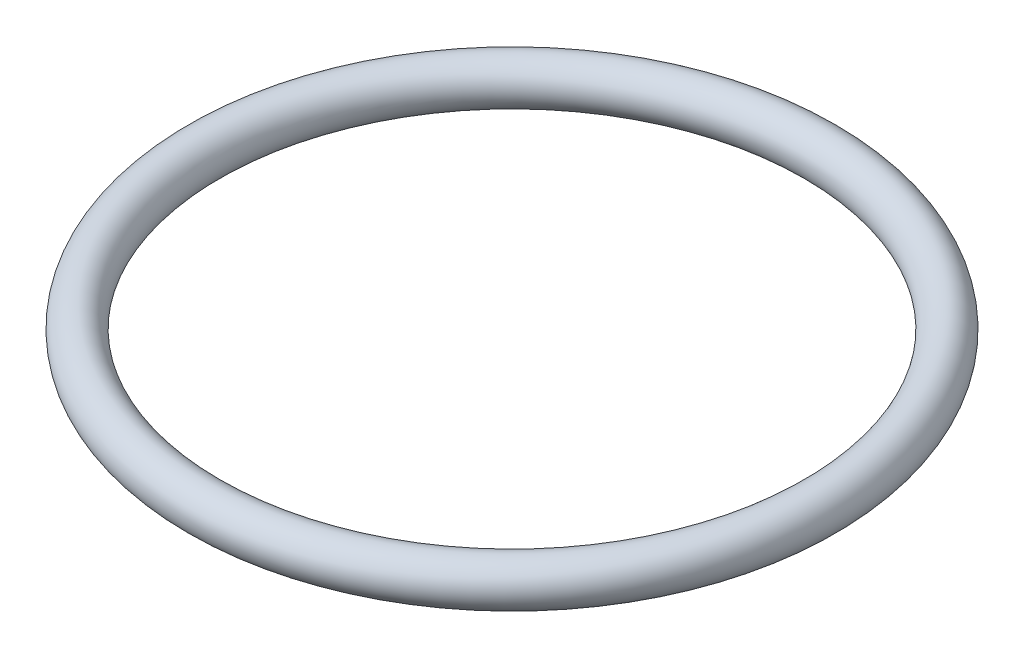
ISO-10303-21;
HEADER;
FILE_DESCRIPTION(('STEP AP214'),'2;1');
FILE_NAME('part.step','',(''),(''),'','','');
FILE_SCHEMA(('AUTOMOTIVE_DESIGN { 1 0 10303 214 1 1 1 1 }'));
ENDSEC;
DATA;
#1=APPLICATION_CONTEXT('core data for automotive mechanical design processes');
#2=APPLICATION_PROTOCOL_DEFINITION('international standard','automotive_design',2000,#1);
#3=PRODUCT_CONTEXT('',#1,'mechanical');
#4=PRODUCT('Part','Part','',(#3));
#5=PRODUCT_RELATED_PRODUCT_CATEGORY('part','',(#4));
#6=PRODUCT_DEFINITION_FORMATION('','',#4);
#7=PRODUCT_DEFINITION_CONTEXT('part definition',#1,'design');
#8=PRODUCT_DEFINITION('design','',#6,#7);
#9=PRODUCT_DEFINITION_SHAPE('','',#8);
#10=(LENGTH_UNIT() NAMED_UNIT(*) SI_UNIT(.MILLI.,.METRE.));
#11=(NAMED_UNIT(*) PLANE_ANGLE_UNIT() SI_UNIT($,.RADIAN.));
#12=(NAMED_UNIT(*) SI_UNIT($,.STERADIAN.) SOLID_ANGLE_UNIT());
#13=UNCERTAINTY_MEASURE_WITH_UNIT(LENGTH_MEASURE(1.E-05),#10,'distance_accuracy_value','');
#14=(GEOMETRIC_REPRESENTATION_CONTEXT(3) GLOBAL_UNCERTAINTY_ASSIGNED_CONTEXT((#13)) GLOBAL_UNIT_ASSIGNED_CONTEXT((#10,
#11,#12)) REPRESENTATION_CONTEXT('',''));
#15=CARTESIAN_POINT('',(0.,0.,0.));
#16=DIRECTION('',(0.,0.,1.));
#17=DIRECTION('',(1.,0.,0.));
#18=AXIS2_PLACEMENT_3D('',#15,#16,#17);
#19=CARTESIAN_POINT('',(0.,0.,0.));
#20=DIRECTION('',(0.,-1.,0.));
#21=DIRECTION('',(0.,0.,-1.));
#22=AXIS2_PLACEMENT_3D('',#19,#20,#21);
#23=TOROIDAL_SURFACE('',#22,175.,12.5);
#24=CARTESIAN_POINT('',(0.,0.,-187.5));
#25=VERTEX_POINT('',#24);
#26=VERTEX_LOOP('',#25);
#27=FACE_BOUND('',#26,.T.);
#28=ADVANCED_FACE('F29',(#27),#23,.T.);
#29=CLOSED_SHELL('',(#28));
#30=MANIFOLD_SOLID_BREP('B2',#29);
#31=ADVANCED_BREP_SHAPE_REPRESENTATION('',(#18,#30),#14);
#32=SHAPE_DEFINITION_REPRESENTATION(#9,#31);
ENDSEC;
END-ISO-10303-21;
